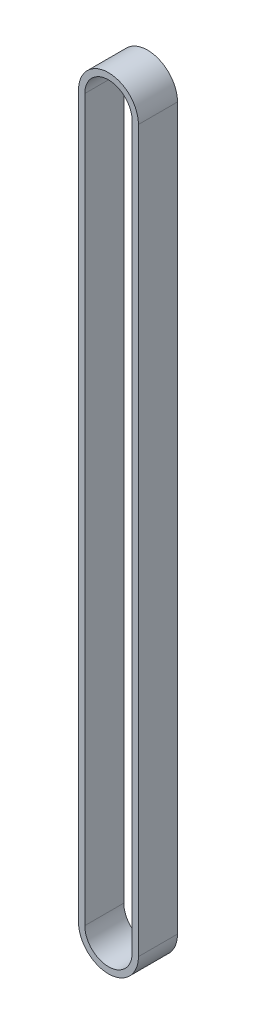
ISO-10303-21;
HEADER;
FILE_DESCRIPTION(('STEP AP214'),'2;1');
FILE_NAME('part.step','',(''),(''),'','','');
FILE_SCHEMA(('AUTOMOTIVE_DESIGN { 1 0 10303 214 1 1 1 1 }'));
ENDSEC;
DATA;
#1=APPLICATION_CONTEXT('core data for automotive mechanical design processes');
#2=APPLICATION_PROTOCOL_DEFINITION('international standard','automotive_design',2000,#1);
#3=PRODUCT_CONTEXT('',#1,'mechanical');
#4=PRODUCT('Part','Part','',(#3));
#5=PRODUCT_RELATED_PRODUCT_CATEGORY('part','',(#4));
#6=PRODUCT_DEFINITION_FORMATION('','',#4);
#7=PRODUCT_DEFINITION_CONTEXT('part definition',#1,'design');
#8=PRODUCT_DEFINITION('design','',#6,#7);
#9=PRODUCT_DEFINITION_SHAPE('','',#8);
#10=(LENGTH_UNIT() NAMED_UNIT(*) SI_UNIT(.MILLI.,.METRE.));
#11=(NAMED_UNIT(*) PLANE_ANGLE_UNIT() SI_UNIT($,.RADIAN.));
#12=(NAMED_UNIT(*) SI_UNIT($,.STERADIAN.) SOLID_ANGLE_UNIT());
#13=UNCERTAINTY_MEASURE_WITH_UNIT(LENGTH_MEASURE(1.E-05),#10,'distance_accuracy_value','');
#14=(GEOMETRIC_REPRESENTATION_CONTEXT(3) GLOBAL_UNCERTAINTY_ASSIGNED_CONTEXT((#13)) GLOBAL_UNIT_ASSIGNED_CONTEXT((#10,
#11,#12)) REPRESENTATION_CONTEXT('',''));
#15=CARTESIAN_POINT('',(0.,0.,0.));
#16=DIRECTION('',(0.,0.,1.));
#17=DIRECTION('',(1.,0.,0.));
#18=AXIS2_PLACEMENT_3D('',#15,#16,#17);
#19=CARTESIAN_POINT('',(0.,201.15329588015,7.5));
#20=DIRECTION('',(0.,0.,1.));
#21=DIRECTION('',(1.,0.,0.));
#22=AXIS2_PLACEMENT_3D('',#19,#20,#21);
#23=PLANE('',#22);
#24=CARTESIAN_POINT('',(0.,201.15329588015,7.5));
#25=DIRECTION('',(0.,0.,1.));
#26=DIRECTION('',(1.,0.,0.));
#27=AXIS2_PLACEMENT_3D('',#24,#25,#26);
#28=CIRCLE('',#27,11.505);
#29=CARTESIAN_POINT('',(11.505,201.15329588015,7.5));
#30=VERTEX_POINT('',#29);
#31=CARTESIAN_POINT('',(-11.505,201.15329588015,7.5));
#32=VERTEX_POINT('',#31);
#33=EDGE_CURVE('E134',#30,#32,#28,.T.);
#34=ORIENTED_EDGE('',*,*,#33,.T.);
#35=DIRECTION('',(0.,-1.,0.));
#36=VECTOR('',#35,1.);
#37=CARTESIAN_POINT('',(-11.505,201.15329588015,7.5));
#38=LINE('',#37,#36);
#39=CARTESIAN_POINT('',(-11.505,-75.6367041198502,7.5));
#40=VERTEX_POINT('',#39);
#41=EDGE_CURVE('E137',#32,#40,#38,.T.);
#42=ORIENTED_EDGE('',*,*,#41,.T.);
#43=CARTESIAN_POINT('',(0.,-75.6367041198502,7.5));
#44=DIRECTION('',(0.,0.,1.));
#45=DIRECTION('',(1.,0.,0.));
#46=AXIS2_PLACEMENT_3D('',#43,#44,#45);
#47=CIRCLE('',#46,11.505);
#48=CARTESIAN_POINT('',(11.505,-75.6367041198502,7.5));
#49=VERTEX_POINT('',#48);
#50=EDGE_CURVE('E140',#40,#49,#47,.T.);
#51=ORIENTED_EDGE('',*,*,#50,.T.);
#52=DIRECTION('',(0.,1.,0.));
#53=VECTOR('',#52,1.);
#54=CARTESIAN_POINT('',(11.505,201.15329588015,7.5));
#55=LINE('',#54,#53);
#56=EDGE_CURVE('E142',#49,#30,#55,.T.);
#57=ORIENTED_EDGE('',*,*,#56,.T.);
#58=EDGE_LOOP('',(#34,#42,#51,#57));
#59=FACE_BOUND('',#58,.T.);
#60=DIRECTION('',(0.,-1.,0.));
#61=VECTOR('',#60,1.);
#62=CARTESIAN_POINT('',(-9.105,201.15329588015,7.5));
#63=LINE('',#62,#61);
#64=CARTESIAN_POINT('',(-9.105,201.15329588015,7.5));
#65=VERTEX_POINT('',#64);
#66=CARTESIAN_POINT('',(-9.105,-75.6367041198502,7.5));
#67=VERTEX_POINT('',#66);
#68=EDGE_CURVE('E106',#65,#67,#63,.T.);
#69=ORIENTED_EDGE('',*,*,#68,.F.);
#70=CARTESIAN_POINT('',(0.,201.15329588015,7.5));
#71=DIRECTION('',(0.,0.,1.));
#72=DIRECTION('',(1.,0.,0.));
#73=AXIS2_PLACEMENT_3D('',#70,#71,#72);
#74=CIRCLE('',#73,9.105);
#75=CARTESIAN_POINT('',(9.105,201.15329588015,7.5));
#76=VERTEX_POINT('',#75);
#77=EDGE_CURVE('E98',#76,#65,#74,.T.);
#78=ORIENTED_EDGE('',*,*,#77,.F.);
#79=DIRECTION('',(0.,1.,0.));
#80=VECTOR('',#79,1.);
#81=CARTESIAN_POINT('',(9.105,201.15329588015,7.5));
#82=LINE('',#81,#80);
#83=CARTESIAN_POINT('',(9.10500000000003,-75.6367041198502,7.5));
#84=VERTEX_POINT('',#83);
#85=EDGE_CURVE('E120',#84,#76,#82,.T.);
#86=ORIENTED_EDGE('',*,*,#85,.F.);
#87=CARTESIAN_POINT('',(0.,-75.6367041198502,7.5));
#88=DIRECTION('',(0.,0.,1.));
#89=DIRECTION('',(1.,0.,0.));
#90=AXIS2_PLACEMENT_3D('',#87,#88,#89);
#91=CIRCLE('',#90,9.105);
#92=EDGE_CURVE('E118',#67,#84,#91,.T.);
#93=ORIENTED_EDGE('',*,*,#92,.F.);
#94=EDGE_LOOP('',(#69,#78,#86,#93));
#95=FACE_BOUND('',#94,.T.);
#96=ADVANCED_FACE('F33',(#59,#95),#23,.T.);
#97=CARTESIAN_POINT('',(0.,201.15329588015,-7.5));
#98=DIRECTION('',(0.,0.,1.));
#99=DIRECTION('',(1.,0.,0.));
#100=AXIS2_PLACEMENT_3D('',#97,#98,#99);
#101=PLANE('',#100);
#102=CARTESIAN_POINT('',(0.,201.15329588015,-7.5));
#103=DIRECTION('',(0.,0.,1.));
#104=DIRECTION('',(1.,0.,0.));
#105=AXIS2_PLACEMENT_3D('',#102,#103,#104);
#106=CIRCLE('',#105,11.505);
#107=CARTESIAN_POINT('',(11.505,201.15329588015,-7.5));
#108=VERTEX_POINT('',#107);
#109=CARTESIAN_POINT('',(-11.505,201.15329588015,-7.5));
#110=VERTEX_POINT('',#109);
#111=EDGE_CURVE('E114',#108,#110,#106,.T.);
#112=ORIENTED_EDGE('',*,*,#111,.F.);
#113=DIRECTION('',(0.,1.,0.));
#114=VECTOR('',#113,1.);
#115=CARTESIAN_POINT('',(11.505,201.15329588015,-7.5));
#116=LINE('',#115,#114);
#117=CARTESIAN_POINT('',(11.505,-75.6367041198502,-7.5));
#118=VERTEX_POINT('',#117);
#119=EDGE_CURVE('E138',#118,#108,#116,.T.);
#120=ORIENTED_EDGE('',*,*,#119,.F.);
#121=CARTESIAN_POINT('',(0.,-75.6367041198502,-7.5));
#122=DIRECTION('',(0.,0.,1.));
#123=DIRECTION('',(1.,0.,0.));
#124=AXIS2_PLACEMENT_3D('',#121,#122,#123);
#125=CIRCLE('',#124,11.505);
#126=CARTESIAN_POINT('',(-11.505,-75.6367041198502,-7.5));
#127=VERTEX_POINT('',#126);
#128=EDGE_CURVE('E149',#127,#118,#125,.T.);
#129=ORIENTED_EDGE('',*,*,#128,.F.);
#130=DIRECTION('',(0.,-1.,0.));
#131=VECTOR('',#130,1.);
#132=CARTESIAN_POINT('',(-11.505,201.15329588015,-7.5));
#133=LINE('',#132,#131);
#134=EDGE_CURVE('E147',#110,#127,#133,.T.);
#135=ORIENTED_EDGE('',*,*,#134,.F.);
#136=EDGE_LOOP('',(#112,#120,#129,#135));
#137=FACE_BOUND('',#136,.T.);
#138=CARTESIAN_POINT('',(0.,201.15329588015,-7.5));
#139=DIRECTION('',(0.,0.,1.));
#140=DIRECTION('',(1.,0.,0.));
#141=AXIS2_PLACEMENT_3D('',#138,#139,#140);
#142=CIRCLE('',#141,9.105);
#143=CARTESIAN_POINT('',(9.105,201.15329588015,-7.5));
#144=VERTEX_POINT('',#143);
#145=CARTESIAN_POINT('',(-9.105,201.15329588015,-7.5));
#146=VERTEX_POINT('',#145);
#147=EDGE_CURVE('E56',#144,#146,#142,.T.);
#148=ORIENTED_EDGE('',*,*,#147,.T.);
#149=DIRECTION('',(0.,-1.,0.));
#150=VECTOR('',#149,1.);
#151=CARTESIAN_POINT('',(-9.105,201.15329588015,-7.5));
#152=LINE('',#151,#150);
#153=CARTESIAN_POINT('',(-9.105,-75.6367041198502,-7.5));
#154=VERTEX_POINT('',#153);
#155=EDGE_CURVE('E113',#146,#154,#152,.T.);
#156=ORIENTED_EDGE('',*,*,#155,.T.);
#157=CARTESIAN_POINT('',(0.,-75.6367041198502,-7.5));
#158=DIRECTION('',(0.,0.,1.));
#159=DIRECTION('',(1.,0.,0.));
#160=AXIS2_PLACEMENT_3D('',#157,#158,#159);
#161=CIRCLE('',#160,9.105);
#162=CARTESIAN_POINT('',(9.10500000000003,-75.6367041198502,-7.5));
#163=VERTEX_POINT('',#162);
#164=EDGE_CURVE('E126',#154,#163,#161,.T.);
#165=ORIENTED_EDGE('',*,*,#164,.T.);
#166=DIRECTION('',(0.,1.,0.));
#167=VECTOR('',#166,1.);
#168=CARTESIAN_POINT('',(9.105,201.15329588015,-7.5));
#169=LINE('',#168,#167);
#170=EDGE_CURVE('E107',#163,#144,#169,.T.);
#171=ORIENTED_EDGE('',*,*,#170,.T.);
#172=EDGE_LOOP('',(#148,#156,#165,#171));
#173=FACE_BOUND('',#172,.T.);
#174=ADVANCED_FACE('F167',(#137,#173),#101,.F.);
#175=CARTESIAN_POINT('',(0.,201.15329588015,7.5));
#176=DIRECTION('',(0.,0.,-1.));
#177=DIRECTION('',(-1.,0.,0.));
#178=AXIS2_PLACEMENT_3D('',#175,#176,#177);
#179=CYLINDRICAL_SURFACE('',#178,11.505);
#180=ORIENTED_EDGE('',*,*,#111,.T.);
#181=DIRECTION('',(0.,0.,-1.));
#182=VECTOR('',#181,1.);
#183=CARTESIAN_POINT('',(-11.505,201.15329588015,7.5));
#184=LINE('',#183,#182);
#185=EDGE_CURVE('E11',#32,#110,#184,.T.);
#186=ORIENTED_EDGE('',*,*,#185,.F.);
#187=ORIENTED_EDGE('',*,*,#33,.F.);
#188=DIRECTION('',(0.,0.,-1.));
#189=VECTOR('',#188,1.);
#190=CARTESIAN_POINT('',(11.505,201.15329588015,7.5));
#191=LINE('',#190,#189);
#192=EDGE_CURVE('E144',#30,#108,#191,.T.);
#193=ORIENTED_EDGE('',*,*,#192,.T.);
#194=EDGE_LOOP('',(#180,#186,#187,#193));
#195=FACE_BOUND('',#194,.T.);
#196=ADVANCED_FACE('F35',(#195),#179,.T.);
#197=CARTESIAN_POINT('',(-11.505,201.15329588015,7.5));
#198=DIRECTION('',(1.,0.,0.));
#199=DIRECTION('',(0.,1.,0.));
#200=AXIS2_PLACEMENT_3D('',#197,#198,#199);
#201=PLANE('',#200);
#202=ORIENTED_EDGE('',*,*,#134,.T.);
#203=DIRECTION('',(0.,0.,-1.));
#204=VECTOR('',#203,1.);
#205=CARTESIAN_POINT('',(-11.505,-75.6367041198502,7.5));
#206=LINE('',#205,#204);
#207=EDGE_CURVE('E41',#40,#127,#206,.T.);
#208=ORIENTED_EDGE('',*,*,#207,.F.);
#209=ORIENTED_EDGE('',*,*,#41,.F.);
#210=ORIENTED_EDGE('',*,*,#185,.T.);
#211=EDGE_LOOP('',(#202,#208,#209,#210));
#212=FACE_BOUND('',#211,.T.);
#213=ADVANCED_FACE('F177',(#212),#201,.F.);
#214=CARTESIAN_POINT('',(0.,-75.6367041198502,7.5));
#215=DIRECTION('',(0.,0.,-1.));
#216=DIRECTION('',(-1.,0.,0.));
#217=AXIS2_PLACEMENT_3D('',#214,#215,#216);
#218=CYLINDRICAL_SURFACE('',#217,11.505);
#219=ORIENTED_EDGE('',*,*,#128,.T.);
#220=DIRECTION('',(0.,0.,-1.));
#221=VECTOR('',#220,1.);
#222=CARTESIAN_POINT('',(11.505,-75.6367041198502,7.5));
#223=LINE('',#222,#221);
#224=EDGE_CURVE('E154',#49,#118,#223,.T.);
#225=ORIENTED_EDGE('',*,*,#224,.F.);
#226=ORIENTED_EDGE('',*,*,#50,.F.);
#227=ORIENTED_EDGE('',*,*,#207,.T.);
#228=EDGE_LOOP('',(#219,#225,#226,#227));
#229=FACE_BOUND('',#228,.T.);
#230=ADVANCED_FACE('F161',(#229),#218,.T.);
#231=CARTESIAN_POINT('',(11.505,201.15329588015,7.5));
#232=DIRECTION('',(-1.,0.,0.));
#233=DIRECTION('',(0.,-1.,0.));
#234=AXIS2_PLACEMENT_3D('',#231,#232,#233);
#235=PLANE('',#234);
#236=ORIENTED_EDGE('',*,*,#119,.T.);
#237=ORIENTED_EDGE('',*,*,#192,.F.);
#238=ORIENTED_EDGE('',*,*,#56,.F.);
#239=ORIENTED_EDGE('',*,*,#224,.T.);
#240=EDGE_LOOP('',(#236,#237,#238,#239));
#241=FACE_BOUND('',#240,.T.);
#242=ADVANCED_FACE('F171',(#241),#235,.F.);
#243=CARTESIAN_POINT('',(0.,201.15329588015,7.5));
#244=DIRECTION('',(0.,0.,-1.));
#245=DIRECTION('',(-1.,0.,0.));
#246=AXIS2_PLACEMENT_3D('',#243,#244,#245);
#247=CYLINDRICAL_SURFACE('',#246,9.105);
#248=ORIENTED_EDGE('',*,*,#147,.F.);
#249=DIRECTION('',(0.,0.,-1.));
#250=VECTOR('',#249,1.);
#251=CARTESIAN_POINT('',(9.105,201.15329588015,7.5));
#252=LINE('',#251,#250);
#253=EDGE_CURVE('E102',#76,#144,#252,.T.);
#254=ORIENTED_EDGE('',*,*,#253,.F.);
#255=ORIENTED_EDGE('',*,*,#77,.T.);
#256=DIRECTION('',(0.,0.,-1.));
#257=VECTOR('',#256,1.);
#258=CARTESIAN_POINT('',(-9.105,201.15329588015,7.5));
#259=LINE('',#258,#257);
#260=EDGE_CURVE('E101',#65,#146,#259,.T.);
#261=ORIENTED_EDGE('',*,*,#260,.T.);
#262=EDGE_LOOP('',(#248,#254,#255,#261));
#263=FACE_BOUND('',#262,.T.);
#264=ADVANCED_FACE('F100',(#263),#247,.F.);
#265=CARTESIAN_POINT('',(-9.105,201.15329588015,7.5));
#266=DIRECTION('',(1.,0.,0.));
#267=DIRECTION('',(0.,1.,0.));
#268=AXIS2_PLACEMENT_3D('',#265,#266,#267);
#269=PLANE('',#268);
#270=ORIENTED_EDGE('',*,*,#155,.F.);
#271=ORIENTED_EDGE('',*,*,#260,.F.);
#272=ORIENTED_EDGE('',*,*,#68,.T.);
#273=DIRECTION('',(0.,0.,-1.));
#274=VECTOR('',#273,1.);
#275=CARTESIAN_POINT('',(-9.105,-75.6367041198502,7.5));
#276=LINE('',#275,#274);
#277=EDGE_CURVE('E115',#67,#154,#276,.T.);
#278=ORIENTED_EDGE('',*,*,#277,.T.);
#279=EDGE_LOOP('',(#270,#271,#272,#278));
#280=FACE_BOUND('',#279,.T.);
#281=ADVANCED_FACE('F110',(#280),#269,.T.);
#282=CARTESIAN_POINT('',(0.,-75.6367041198502,7.5));
#283=DIRECTION('',(0.,0.,-1.));
#284=DIRECTION('',(-1.,0.,0.));
#285=AXIS2_PLACEMENT_3D('',#282,#283,#284);
#286=CYLINDRICAL_SURFACE('',#285,9.105);
#287=ORIENTED_EDGE('',*,*,#164,.F.);
#288=ORIENTED_EDGE('',*,*,#277,.F.);
#289=ORIENTED_EDGE('',*,*,#92,.T.);
#290=DIRECTION('',(0.,0.,-1.));
#291=VECTOR('',#290,1.);
#292=CARTESIAN_POINT('',(9.10500000000003,-75.6367041198502,7.5));
#293=LINE('',#292,#291);
#294=EDGE_CURVE('E48',#84,#163,#293,.T.);
#295=ORIENTED_EDGE('',*,*,#294,.T.);
#296=EDGE_LOOP('',(#287,#288,#289,#295));
#297=FACE_BOUND('',#296,.T.);
#298=ADVANCED_FACE('F200',(#297),#286,.F.);
#299=CARTESIAN_POINT('',(9.105,201.15329588015,7.5));
#300=DIRECTION('',(-1.,0.,0.));
#301=DIRECTION('',(0.,-1.,0.));
#302=AXIS2_PLACEMENT_3D('',#299,#300,#301);
#303=PLANE('',#302);
#304=ORIENTED_EDGE('',*,*,#170,.F.);
#305=ORIENTED_EDGE('',*,*,#294,.F.);
#306=ORIENTED_EDGE('',*,*,#85,.T.);
#307=ORIENTED_EDGE('',*,*,#253,.T.);
#308=EDGE_LOOP('',(#304,#305,#306,#307));
#309=FACE_BOUND('',#308,.T.);
#310=ADVANCED_FACE('F204',(#309),#303,.T.);
#311=CLOSED_SHELL('',(#96,#174,#196,#213,#230,#242,#264,#281,#298,#310));
#312=MANIFOLD_SOLID_BREP('B2',#311);
#313=ADVANCED_BREP_SHAPE_REPRESENTATION('',(#18,#312),#14);
#314=SHAPE_DEFINITION_REPRESENTATION(#9,#313);
ENDSEC;
END-ISO-10303-21;
